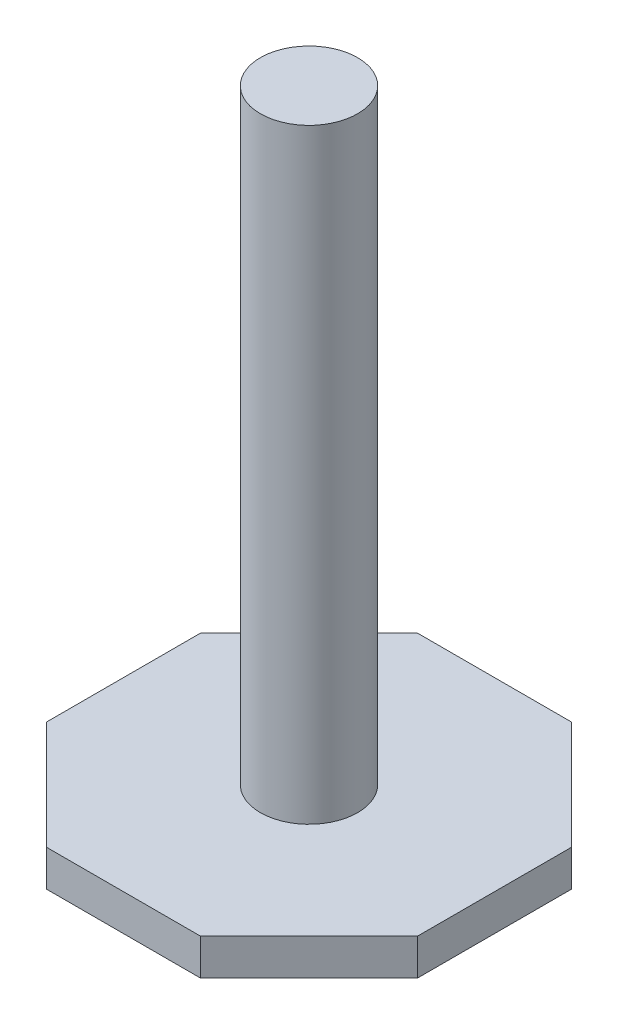
ISO-10303-21;
HEADER;
FILE_DESCRIPTION(('STEP AP214'),'2;1');
FILE_NAME('part.step','',(''),(''),'','','');
FILE_SCHEMA(('AUTOMOTIVE_DESIGN { 1 0 10303 214 1 1 1 1 }'));
ENDSEC;
DATA;
#1=APPLICATION_CONTEXT('core data for automotive mechanical design processes');
#2=APPLICATION_PROTOCOL_DEFINITION('international standard','automotive_design',2000,#1);
#3=PRODUCT_CONTEXT('',#1,'mechanical');
#4=PRODUCT('Part','Part','',(#3));
#5=PRODUCT_RELATED_PRODUCT_CATEGORY('part','',(#4));
#6=PRODUCT_DEFINITION_FORMATION('','',#4);
#7=PRODUCT_DEFINITION_CONTEXT('part definition',#1,'design');
#8=PRODUCT_DEFINITION('design','',#6,#7);
#9=PRODUCT_DEFINITION_SHAPE('','',#8);
#10=(LENGTH_UNIT() NAMED_UNIT(*) SI_UNIT(.MILLI.,.METRE.));
#11=(NAMED_UNIT(*) PLANE_ANGLE_UNIT() SI_UNIT($,.RADIAN.));
#12=(NAMED_UNIT(*) SI_UNIT($,.STERADIAN.) SOLID_ANGLE_UNIT());
#13=UNCERTAINTY_MEASURE_WITH_UNIT(LENGTH_MEASURE(1.E-05),#10,'distance_accuracy_value','');
#14=(GEOMETRIC_REPRESENTATION_CONTEXT(3) GLOBAL_UNCERTAINTY_ASSIGNED_CONTEXT((#13)) GLOBAL_UNIT_ASSIGNED_CONTEXT((#10,
#11,#12)) REPRESENTATION_CONTEXT('',''));
#15=CARTESIAN_POINT('',(0.,0.,0.));
#16=DIRECTION('',(0.,0.,1.));
#17=DIRECTION('',(1.,0.,0.));
#18=AXIS2_PLACEMENT_3D('',#15,#16,#17);
#19=CARTESIAN_POINT('',(0.,50.,0.));
#20=DIRECTION('',(0.,-1.,0.));
#21=DIRECTION('',(0.,0.,-1.));
#22=AXIS2_PLACEMENT_3D('',#19,#20,#21);
#23=CYLINDRICAL_SURFACE('',#22,4.015);
#24=CARTESIAN_POINT('',(0.,50.,0.));
#25=DIRECTION('',(0.,1.,0.));
#26=DIRECTION('',(0.,0.,1.));
#27=AXIS2_PLACEMENT_3D('',#24,#25,#26);
#28=CIRCLE('',#27,4.015);
#29=CARTESIAN_POINT('',(0.,50.,4.015));
#30=VERTEX_POINT('',#29);
#31=EDGE_CURVE('E11',#30,#30,#28,.T.);
#32=ORIENTED_EDGE('',*,*,#31,.F.);
#33=EDGE_LOOP('',(#32));
#34=FACE_BOUND('',#33,.T.);
#35=CARTESIAN_POINT('',(0.,0.,0.));
#36=DIRECTION('',(0.,1.,0.));
#37=DIRECTION('',(0.,0.,1.));
#38=AXIS2_PLACEMENT_3D('',#35,#36,#37);
#39=CIRCLE('',#38,4.015);
#40=CARTESIAN_POINT('',(0.,0.,4.015));
#41=VERTEX_POINT('',#40);
#42=EDGE_CURVE('E43',#41,#41,#39,.T.);
#43=ORIENTED_EDGE('',*,*,#42,.T.);
#44=EDGE_LOOP('',(#43));
#45=FACE_BOUND('',#44,.T.);
#46=ADVANCED_FACE('F40',(#34,#45),#23,.T.);
#47=CARTESIAN_POINT('',(0.,50.,0.));
#48=DIRECTION('',(0.,1.,0.));
#49=DIRECTION('',(0.,0.,1.));
#50=AXIS2_PLACEMENT_3D('',#47,#48,#49);
#51=PLANE('',#50);
#52=ORIENTED_EDGE('',*,*,#31,.T.);
#53=EDGE_LOOP('',(#52));
#54=FACE_BOUND('',#53,.T.);
#55=ADVANCED_FACE('F448',(#54),#51,.T.);
#56=CARTESIAN_POINT('',(15.3201327539249,-3.,6.34580676403199));
#57=DIRECTION('',(-0.707106781186547,0.,-0.707106781186548));
#58=DIRECTION('',(-0.707106781186548,0.,0.707106781186547));
#59=AXIS2_PLACEMENT_3D('',#56,#57,#58);
#60=PLANE('',#59);
#61=DIRECTION('',(-0.707106781186548,0.,0.707106781186547));
#62=VECTOR('',#61,1.);
#63=CARTESIAN_POINT('',(15.3201327539249,0.,6.34580676403199));
#64=LINE('',#63,#62);
#65=CARTESIAN_POINT('',(15.3201327539249,0.,6.34580676403199));
#66=VERTEX_POINT('',#65);
#67=CARTESIAN_POINT('',(6.34580676403198,0.,15.3201327539249));
#68=VERTEX_POINT('',#67);
#69=EDGE_CURVE('E303',#66,#68,#64,.T.);
#70=ORIENTED_EDGE('',*,*,#69,.T.);
#71=DIRECTION('',(0.,1.,0.));
#72=VECTOR('',#71,1.);
#73=CARTESIAN_POINT('',(6.34580676403198,-3.,15.3201327539249));
#74=LINE('',#73,#72);
#75=CARTESIAN_POINT('',(6.34580676403198,-3.,15.3201327539249));
#76=VERTEX_POINT('',#75);
#77=EDGE_CURVE('E385',#76,#68,#74,.T.);
#78=ORIENTED_EDGE('',*,*,#77,.F.);
#79=DIRECTION('',(-0.707106781186548,0.,0.707106781186547));
#80=VECTOR('',#79,1.);
#81=CARTESIAN_POINT('',(15.3201327539249,-3.,6.34580676403199));
#82=LINE('',#81,#80);
#83=CARTESIAN_POINT('',(15.3201327539249,-3.,6.34580676403199));
#84=VERTEX_POINT('',#83);
#85=EDGE_CURVE('E331',#84,#76,#82,.T.);
#86=ORIENTED_EDGE('',*,*,#85,.F.);
#87=DIRECTION('',(0.,1.,0.));
#88=VECTOR('',#87,1.);
#89=CARTESIAN_POINT('',(15.3201327539249,-3.,6.34580676403199));
#90=LINE('',#89,#88);
#91=EDGE_CURVE('E349',#84,#66,#90,.T.);
#92=ORIENTED_EDGE('',*,*,#91,.T.);
#93=EDGE_LOOP('',(#70,#78,#86,#92));
#94=FACE_BOUND('',#93,.T.);
#95=ADVANCED_FACE('F404',(#94),#60,.F.);
#96=CARTESIAN_POINT('',(6.34580676403198,-3.,15.3201327539249));
#97=DIRECTION('',(0.,0.,-1.));
#98=DIRECTION('',(-1.,0.,0.));
#99=AXIS2_PLACEMENT_3D('',#96,#97,#98);
#100=PLANE('',#99);
#101=DIRECTION('',(-1.,0.,0.));
#102=VECTOR('',#101,1.);
#103=CARTESIAN_POINT('',(6.34580676403198,0.,15.3201327539249));
#104=LINE('',#103,#102);
#105=CARTESIAN_POINT('',(-6.34580676403199,0.,15.3201327539249));
#106=VERTEX_POINT('',#105);
#107=EDGE_CURVE('E352',#68,#106,#104,.T.);
#108=ORIENTED_EDGE('',*,*,#107,.T.);
#109=DIRECTION('',(0.,1.,0.));
#110=VECTOR('',#109,1.);
#111=CARTESIAN_POINT('',(-6.34580676403199,-3.,15.3201327539249));
#112=LINE('',#111,#110);
#113=CARTESIAN_POINT('',(-6.34580676403199,-3.,15.3201327539249));
#114=VERTEX_POINT('',#113);
#115=EDGE_CURVE('E382',#114,#106,#112,.T.);
#116=ORIENTED_EDGE('',*,*,#115,.F.);
#117=DIRECTION('',(-1.,0.,0.));
#118=VECTOR('',#117,1.);
#119=CARTESIAN_POINT('',(6.34580676403198,-3.,15.3201327539249));
#120=LINE('',#119,#118);
#121=EDGE_CURVE('E334',#76,#114,#120,.T.);
#122=ORIENTED_EDGE('',*,*,#121,.F.);
#123=ORIENTED_EDGE('',*,*,#77,.T.);
#124=EDGE_LOOP('',(#108,#116,#122,#123));
#125=FACE_BOUND('',#124,.T.);
#126=ADVANCED_FACE('F434',(#125),#100,.F.);
#127=CARTESIAN_POINT('',(-6.34580676403199,-3.,15.3201327539249));
#128=DIRECTION('',(0.707106781186548,0.,-0.707106781186547));
#129=DIRECTION('',(-0.707106781186547,0.,-0.707106781186548));
#130=AXIS2_PLACEMENT_3D('',#127,#128,#129);
#131=PLANE('',#130);
#132=DIRECTION('',(-0.707106781186547,0.,-0.707106781186548));
#133=VECTOR('',#132,1.);
#134=CARTESIAN_POINT('',(-6.34580676403199,0.,15.3201327539249));
#135=LINE('',#134,#133);
#136=CARTESIAN_POINT('',(-15.3201327539249,0.,6.34580676403198));
#137=VERTEX_POINT('',#136);
#138=EDGE_CURVE('E354',#106,#137,#135,.T.);
#139=ORIENTED_EDGE('',*,*,#138,.T.);
#140=DIRECTION('',(0.,1.,0.));
#141=VECTOR('',#140,1.);
#142=CARTESIAN_POINT('',(-15.3201327539249,-3.,6.34580676403198));
#143=LINE('',#142,#141);
#144=CARTESIAN_POINT('',(-15.3201327539249,-3.,6.34580676403198));
#145=VERTEX_POINT('',#144);
#146=EDGE_CURVE('E379',#145,#137,#143,.T.);
#147=ORIENTED_EDGE('',*,*,#146,.F.);
#148=DIRECTION('',(-0.707106781186547,0.,-0.707106781186548));
#149=VECTOR('',#148,1.);
#150=CARTESIAN_POINT('',(-6.34580676403199,-3.,15.3201327539249));
#151=LINE('',#150,#149);
#152=EDGE_CURVE('E337',#114,#145,#151,.T.);
#153=ORIENTED_EDGE('',*,*,#152,.F.);
#154=ORIENTED_EDGE('',*,*,#115,.T.);
#155=EDGE_LOOP('',(#139,#147,#153,#154));
#156=FACE_BOUND('',#155,.T.);
#157=ADVANCED_FACE('F431',(#156),#131,.F.);
#158=CARTESIAN_POINT('',(-15.3201327539249,-3.,6.34580676403198));
#159=DIRECTION('',(1.,0.,0.));
#160=DIRECTION('',(0.,0.,-1.));
#161=AXIS2_PLACEMENT_3D('',#158,#159,#160);
#162=PLANE('',#161);
#163=DIRECTION('',(0.,0.,-1.));
#164=VECTOR('',#163,1.);
#165=CARTESIAN_POINT('',(-15.3201327539249,0.,6.34580676403198));
#166=LINE('',#165,#164);
#167=CARTESIAN_POINT('',(-15.3201327539249,0.,-6.34580676403198));
#168=VERTEX_POINT('',#167);
#169=EDGE_CURVE('E356',#137,#168,#166,.T.);
#170=ORIENTED_EDGE('',*,*,#169,.T.);
#171=DIRECTION('',(0.,1.,0.));
#172=VECTOR('',#171,1.);
#173=CARTESIAN_POINT('',(-15.3201327539249,-3.,-6.34580676403198));
#174=LINE('',#173,#172);
#175=CARTESIAN_POINT('',(-15.3201327539249,-3.,-6.34580676403198));
#176=VERTEX_POINT('',#175);
#177=EDGE_CURVE('E376',#176,#168,#174,.T.);
#178=ORIENTED_EDGE('',*,*,#177,.F.);
#179=DIRECTION('',(0.,0.,-1.));
#180=VECTOR('',#179,1.);
#181=CARTESIAN_POINT('',(-15.3201327539249,-3.,6.34580676403198));
#182=LINE('',#181,#180);
#183=EDGE_CURVE('E339',#145,#176,#182,.T.);
#184=ORIENTED_EDGE('',*,*,#183,.F.);
#185=ORIENTED_EDGE('',*,*,#146,.T.);
#186=EDGE_LOOP('',(#170,#178,#184,#185));
#187=FACE_BOUND('',#186,.T.);
#188=ADVANCED_FACE('F428',(#187),#162,.F.);
#189=CARTESIAN_POINT('',(-15.3201327539249,-3.,-6.34580676403198));
#190=DIRECTION('',(0.707106781186547,0.,0.707106781186548));
#191=DIRECTION('',(0.707106781186548,0.,-0.707106781186547));
#192=AXIS2_PLACEMENT_3D('',#189,#190,#191);
#193=PLANE('',#192);
#194=DIRECTION('',(0.707106781186548,0.,-0.707106781186547));
#195=VECTOR('',#194,1.);
#196=CARTESIAN_POINT('',(-15.3201327539249,0.,-6.34580676403198));
#197=LINE('',#196,#195);
#198=CARTESIAN_POINT('',(-6.34580676403198,0.,-15.3201327539249));
#199=VERTEX_POINT('',#198);
#200=EDGE_CURVE('E358',#168,#199,#197,.T.);
#201=ORIENTED_EDGE('',*,*,#200,.T.);
#202=DIRECTION('',(0.,1.,0.));
#203=VECTOR('',#202,1.);
#204=CARTESIAN_POINT('',(-6.34580676403198,-3.,-15.3201327539249));
#205=LINE('',#204,#203);
#206=CARTESIAN_POINT('',(-6.34580676403198,-3.,-15.3201327539249));
#207=VERTEX_POINT('',#206);
#208=EDGE_CURVE('E373',#207,#199,#205,.T.);
#209=ORIENTED_EDGE('',*,*,#208,.F.);
#210=DIRECTION('',(0.707106781186548,0.,-0.707106781186547));
#211=VECTOR('',#210,1.);
#212=CARTESIAN_POINT('',(-15.3201327539249,-3.,-6.34580676403198));
#213=LINE('',#212,#211);
#214=EDGE_CURVE('E341',#176,#207,#213,.T.);
#215=ORIENTED_EDGE('',*,*,#214,.F.);
#216=ORIENTED_EDGE('',*,*,#177,.T.);
#217=EDGE_LOOP('',(#201,#209,#215,#216));
#218=FACE_BOUND('',#217,.T.);
#219=ADVANCED_FACE('F424',(#218),#193,.F.);
#220=CARTESIAN_POINT('',(-6.34580676403198,-3.,-15.3201327539249));
#221=DIRECTION('',(0.,0.,1.));
#222=DIRECTION('',(1.,0.,0.));
#223=AXIS2_PLACEMENT_3D('',#220,#221,#222);
#224=PLANE('',#223);
#225=DIRECTION('',(1.,0.,0.));
#226=VECTOR('',#225,1.);
#227=CARTESIAN_POINT('',(-6.34580676403198,0.,-15.3201327539249));
#228=LINE('',#227,#226);
#229=CARTESIAN_POINT('',(6.34580676403199,0.,-15.3201327539249));
#230=VERTEX_POINT('',#229);
#231=EDGE_CURVE('E360',#199,#230,#228,.T.);
#232=ORIENTED_EDGE('',*,*,#231,.T.);
#233=DIRECTION('',(0.,1.,0.));
#234=VECTOR('',#233,1.);
#235=CARTESIAN_POINT('',(6.34580676403199,-3.,-15.3201327539249));
#236=LINE('',#235,#234);
#237=CARTESIAN_POINT('',(6.34580676403199,-3.,-15.3201327539249));
#238=VERTEX_POINT('',#237);
#239=EDGE_CURVE('E370',#238,#230,#236,.T.);
#240=ORIENTED_EDGE('',*,*,#239,.F.);
#241=DIRECTION('',(1.,0.,0.));
#242=VECTOR('',#241,1.);
#243=CARTESIAN_POINT('',(-6.34580676403198,-3.,-15.3201327539249));
#244=LINE('',#243,#242);
#245=EDGE_CURVE('E343',#207,#238,#244,.T.);
#246=ORIENTED_EDGE('',*,*,#245,.F.);
#247=ORIENTED_EDGE('',*,*,#208,.T.);
#248=EDGE_LOOP('',(#232,#240,#246,#247));
#249=FACE_BOUND('',#248,.T.);
#250=ADVANCED_FACE('F419',(#249),#224,.F.);
#251=CARTESIAN_POINT('',(6.34580676403199,-3.,-15.3201327539249));
#252=DIRECTION('',(-0.707106781186548,0.,0.707106781186547));
#253=DIRECTION('',(0.707106781186547,0.,0.707106781186548));
#254=AXIS2_PLACEMENT_3D('',#251,#252,#253);
#255=PLANE('',#254);
#256=DIRECTION('',(0.707106781186548,0.,0.707106781186548));
#257=VECTOR('',#256,1.);
#258=CARTESIAN_POINT('',(6.34580676403199,0.,-15.3201327539249));
#259=LINE('',#258,#257);
#260=CARTESIAN_POINT('',(15.3201327539249,0.,-6.34580676403198));
#261=VERTEX_POINT('',#260);
#262=EDGE_CURVE('E362',#230,#261,#259,.T.);
#263=ORIENTED_EDGE('',*,*,#262,.T.);
#264=DIRECTION('',(0.,1.,0.));
#265=VECTOR('',#264,1.);
#266=CARTESIAN_POINT('',(15.3201327539249,-3.,-6.34580676403198));
#267=LINE('',#266,#265);
#268=CARTESIAN_POINT('',(15.3201327539249,-3.,-6.34580676403198));
#269=VERTEX_POINT('',#268);
#270=EDGE_CURVE('E367',#269,#261,#267,.T.);
#271=ORIENTED_EDGE('',*,*,#270,.F.);
#272=DIRECTION('',(0.707106781186548,0.,0.707106781186548));
#273=VECTOR('',#272,1.);
#274=CARTESIAN_POINT('',(6.34580676403199,-3.,-15.3201327539249));
#275=LINE('',#274,#273);
#276=EDGE_CURVE('E345',#238,#269,#275,.T.);
#277=ORIENTED_EDGE('',*,*,#276,.F.);
#278=ORIENTED_EDGE('',*,*,#239,.T.);
#279=EDGE_LOOP('',(#263,#271,#277,#278));
#280=FACE_BOUND('',#279,.T.);
#281=ADVANCED_FACE('F413',(#280),#255,.F.);
#282=CARTESIAN_POINT('',(15.3201327539249,-3.,-6.34580676403198));
#283=DIRECTION('',(-1.,0.,0.));
#284=DIRECTION('',(0.,0.,1.));
#285=AXIS2_PLACEMENT_3D('',#282,#283,#284);
#286=PLANE('',#285);
#287=DIRECTION('',(0.,0.,1.));
#288=VECTOR('',#287,1.);
#289=CARTESIAN_POINT('',(15.3201327539249,0.,-6.34580676403198));
#290=LINE('',#289,#288);
#291=EDGE_CURVE('E335',#261,#66,#290,.T.);
#292=ORIENTED_EDGE('',*,*,#291,.T.);
#293=ORIENTED_EDGE('',*,*,#91,.F.);
#294=DIRECTION('',(0.,0.,1.));
#295=VECTOR('',#294,1.);
#296=CARTESIAN_POINT('',(15.3201327539249,-3.,-6.34580676403198));
#297=LINE('',#296,#295);
#298=EDGE_CURVE('E347',#269,#84,#297,.T.);
#299=ORIENTED_EDGE('',*,*,#298,.F.);
#300=ORIENTED_EDGE('',*,*,#270,.T.);
#301=EDGE_LOOP('',(#292,#293,#299,#300));
#302=FACE_BOUND('',#301,.T.);
#303=ADVANCED_FACE('F409',(#302),#286,.F.);
#304=CARTESIAN_POINT('',(0.,-3.,0.));
#305=DIRECTION('',(0.,-1.,0.));
#306=DIRECTION('',(0.,0.,-1.));
#307=AXIS2_PLACEMENT_3D('',#304,#305,#306);
#308=PLANE('',#307);
#309=DIRECTION('',(0.707106781186548,0.,-0.707106781186548));
#310=VECTOR('',#309,1.);
#311=CARTESIAN_POINT('',(-10.1258629777919,-3.,-10.1258629777919));
#312=LINE('',#311,#310);
#313=CARTESIAN_POINT('',(-14.3201327539249,-3.,-5.93159320165889));
#314=VERTEX_POINT('',#313);
#315=CARTESIAN_POINT('',(-5.93159320165889,-3.,-14.3201327539249));
#316=VERTEX_POINT('',#315);
#317=EDGE_CURVE('E62',#314,#316,#312,.T.);
#318=ORIENTED_EDGE('',*,*,#317,.F.);
#319=DIRECTION('',(0.,0.,-1.));
#320=VECTOR('',#319,1.);
#321=CARTESIAN_POINT('',(-14.3201327539249,-3.,0.));
#322=LINE('',#321,#320);
#323=CARTESIAN_POINT('',(-14.3201327539249,-3.,5.93159320165889));
#324=VERTEX_POINT('',#323);
#325=EDGE_CURVE('E223',#324,#314,#322,.T.);
#326=ORIENTED_EDGE('',*,*,#325,.F.);
#327=DIRECTION('',(-0.707106781186547,0.,-0.707106781186548));
#328=VECTOR('',#327,1.);
#329=CARTESIAN_POINT('',(-10.1258629777919,-3.,10.1258629777919));
#330=LINE('',#329,#328);
#331=CARTESIAN_POINT('',(-5.93159320165889,-3.,14.320132753925));
#332=VERTEX_POINT('',#331);
#333=EDGE_CURVE('E226',#332,#324,#330,.T.);
#334=ORIENTED_EDGE('',*,*,#333,.F.);
#335=DIRECTION('',(-1.,0.,0.));
#336=VECTOR('',#335,1.);
#337=CARTESIAN_POINT('',(0.,-3.,14.320132753925));
#338=LINE('',#337,#336);
#339=CARTESIAN_POINT('',(5.93159320165888,-3.,14.320132753925));
#340=VERTEX_POINT('',#339);
#341=EDGE_CURVE('E296',#340,#332,#338,.T.);
#342=ORIENTED_EDGE('',*,*,#341,.F.);
#343=DIRECTION('',(-0.707106781186548,0.,0.707106781186547));
#344=VECTOR('',#343,1.);
#345=CARTESIAN_POINT('',(10.1258629777919,-3.,10.1258629777919));
#346=LINE('',#345,#344);
#347=CARTESIAN_POINT('',(14.3201327539249,-3.,5.9315932016589));
#348=VERTEX_POINT('',#347);
#349=EDGE_CURVE('E293',#348,#340,#346,.T.);
#350=ORIENTED_EDGE('',*,*,#349,.F.);
#351=DIRECTION('',(0.,0.,1.));
#352=VECTOR('',#351,1.);
#353=CARTESIAN_POINT('',(14.3201327539249,-3.,0.));
#354=LINE('',#353,#352);
#355=CARTESIAN_POINT('',(14.3201327539249,-3.,-5.93159320165889));
#356=VERTEX_POINT('',#355);
#357=EDGE_CURVE('E290',#356,#348,#354,.T.);
#358=ORIENTED_EDGE('',*,*,#357,.F.);
#359=DIRECTION('',(0.707106781186547,0.,0.707106781186548));
#360=VECTOR('',#359,1.);
#361=CARTESIAN_POINT('',(10.1258629777919,-3.,-10.1258629777919));
#362=LINE('',#361,#360);
#363=CARTESIAN_POINT('',(5.9315932016589,-3.,-14.3201327539249));
#364=VERTEX_POINT('',#363);
#365=EDGE_CURVE('E287',#364,#356,#362,.T.);
#366=ORIENTED_EDGE('',*,*,#365,.F.);
#367=DIRECTION('',(1.,0.,0.));
#368=VECTOR('',#367,1.);
#369=CARTESIAN_POINT('',(0.,-3.,-14.3201327539249));
#370=LINE('',#369,#368);
#371=EDGE_CURVE('E284',#316,#364,#370,.T.);
#372=ORIENTED_EDGE('',*,*,#371,.F.);
#373=EDGE_LOOP('',(#318,#326,#334,#342,#350,#358,#366,#372));
#374=FACE_BOUND('',#373,.T.);
#375=ORIENTED_EDGE('',*,*,#85,.T.);
#376=ORIENTED_EDGE('',*,*,#121,.T.);
#377=ORIENTED_EDGE('',*,*,#152,.T.);
#378=ORIENTED_EDGE('',*,*,#183,.T.);
#379=ORIENTED_EDGE('',*,*,#214,.T.);
#380=ORIENTED_EDGE('',*,*,#245,.T.);
#381=ORIENTED_EDGE('',*,*,#276,.T.);
#382=ORIENTED_EDGE('',*,*,#298,.T.);
#383=EDGE_LOOP('',(#375,#376,#377,#378,#379,#380,#381,#382));
#384=FACE_BOUND('',#383,.T.);
#385=ADVANCED_FACE('F397',(#374,#384),#308,.T.);
#386=CARTESIAN_POINT('',(0.,0.,0.));
#387=DIRECTION('',(0.,-1.,0.));
#388=DIRECTION('',(0.,0.,-1.));
#389=AXIS2_PLACEMENT_3D('',#386,#387,#388);
#390=PLANE('',#389);
#391=ORIENTED_EDGE('',*,*,#42,.F.);
#392=EDGE_LOOP('',(#391));
#393=FACE_BOUND('',#392,.T.);
#394=ORIENTED_EDGE('',*,*,#69,.F.);
#395=ORIENTED_EDGE('',*,*,#291,.F.);
#396=ORIENTED_EDGE('',*,*,#262,.F.);
#397=ORIENTED_EDGE('',*,*,#231,.F.);
#398=ORIENTED_EDGE('',*,*,#200,.F.);
#399=ORIENTED_EDGE('',*,*,#169,.F.);
#400=ORIENTED_EDGE('',*,*,#138,.F.);
#401=ORIENTED_EDGE('',*,*,#107,.F.);
#402=EDGE_LOOP('',(#394,#395,#396,#397,#398,#399,#400,#401));
#403=FACE_BOUND('',#402,.T.);
#404=ADVANCED_FACE('F393',(#393,#403),#390,.F.);
#405=CARTESIAN_POINT('',(-10.1258629777919,-2.,-10.1258629777919));
#406=DIRECTION('',(-0.707106781186547,0.,-0.707106781186547));
#407=DIRECTION('',(-0.707106781186548,0.,0.707106781186548));
#408=AXIS2_PLACEMENT_3D('',#405,#406,#407);
#409=PLANE('',#408);
#410=ORIENTED_EDGE('',*,*,#317,.T.);
#411=DIRECTION('',(0.,-1.,0.));
#412=VECTOR('',#411,1.);
#413=CARTESIAN_POINT('',(-5.93159320165889,-2.,-14.3201327539249));
#414=LINE('',#413,#412);
#415=CARTESIAN_POINT('',(-5.93159320165889,-2.,-14.3201327539249));
#416=VERTEX_POINT('',#415);
#417=EDGE_CURVE('E316',#416,#316,#414,.T.);
#418=ORIENTED_EDGE('',*,*,#417,.F.);
#419=DIRECTION('',(0.707106781186548,0.,-0.707106781186548));
#420=VECTOR('',#419,1.);
#421=CARTESIAN_POINT('',(-10.1258629777919,-2.,-10.1258629777919));
#422=LINE('',#421,#420);
#423=CARTESIAN_POINT('',(-14.3201327539249,-2.,-5.93159320165889));
#424=VERTEX_POINT('',#423);
#425=EDGE_CURVE('E239',#424,#416,#422,.T.);
#426=ORIENTED_EDGE('',*,*,#425,.F.);
#427=DIRECTION('',(0.,-1.,0.));
#428=VECTOR('',#427,1.);
#429=CARTESIAN_POINT('',(-14.3201327539249,-2.,-5.93159320165889));
#430=LINE('',#429,#428);
#431=EDGE_CURVE('E301',#424,#314,#430,.T.);
#432=ORIENTED_EDGE('',*,*,#431,.T.);
#433=EDGE_LOOP('',(#410,#418,#426,#432));
#434=FACE_BOUND('',#433,.T.);
#435=ADVANCED_FACE('F396',(#434),#409,.F.);
#436=CARTESIAN_POINT('',(-14.3201327539249,-2.,0.));
#437=DIRECTION('',(-1.,0.,0.));
#438=DIRECTION('',(0.,0.,1.));
#439=AXIS2_PLACEMENT_3D('',#436,#437,#438);
#440=PLANE('',#439);
#441=ORIENTED_EDGE('',*,*,#325,.T.);
#442=ORIENTED_EDGE('',*,*,#431,.F.);
#443=DIRECTION('',(0.,0.,-1.));
#444=VECTOR('',#443,1.);
#445=CARTESIAN_POINT('',(-14.3201327539249,-2.,0.));
#446=LINE('',#445,#444);
#447=CARTESIAN_POINT('',(-14.3201327539249,-2.,5.93159320165889));
#448=VERTEX_POINT('',#447);
#449=EDGE_CURVE('E217',#448,#424,#446,.T.);
#450=ORIENTED_EDGE('',*,*,#449,.F.);
#451=DIRECTION('',(0.,-1.,0.));
#452=VECTOR('',#451,1.);
#453=CARTESIAN_POINT('',(-14.3201327539249,-2.,5.93159320165889));
#454=LINE('',#453,#452);
#455=EDGE_CURVE('E304',#448,#324,#454,.T.);
#456=ORIENTED_EDGE('',*,*,#455,.T.);
#457=EDGE_LOOP('',(#441,#442,#450,#456));
#458=FACE_BOUND('',#457,.T.);
#459=ADVANCED_FACE('F502',(#458),#440,.F.);
#460=CARTESIAN_POINT('',(-10.1258629777919,-2.,10.1258629777919));
#461=DIRECTION('',(-0.707106781186548,0.,0.707106781186547));
#462=DIRECTION('',(0.707106781186547,0.,0.707106781186548));
#463=AXIS2_PLACEMENT_3D('',#460,#461,#462);
#464=PLANE('',#463);
#465=ORIENTED_EDGE('',*,*,#333,.T.);
#466=ORIENTED_EDGE('',*,*,#455,.F.);
#467=DIRECTION('',(-0.707106781186547,0.,-0.707106781186548));
#468=VECTOR('',#467,1.);
#469=CARTESIAN_POINT('',(-10.1258629777919,-2.,10.1258629777919));
#470=LINE('',#469,#468);
#471=CARTESIAN_POINT('',(-5.93159320165889,-2.,14.320132753925));
#472=VERTEX_POINT('',#471);
#473=EDGE_CURVE('E257',#472,#448,#470,.T.);
#474=ORIENTED_EDGE('',*,*,#473,.F.);
#475=DIRECTION('',(0.,-1.,0.));
#476=VECTOR('',#475,1.);
#477=CARTESIAN_POINT('',(-5.93159320165889,-2.,14.320132753925));
#478=LINE('',#477,#476);
#479=EDGE_CURVE('E306',#472,#332,#478,.T.);
#480=ORIENTED_EDGE('',*,*,#479,.T.);
#481=EDGE_LOOP('',(#465,#466,#474,#480));
#482=FACE_BOUND('',#481,.T.);
#483=ADVANCED_FACE('F512',(#482),#464,.F.);
#484=CARTESIAN_POINT('',(0.,-2.,14.320132753925));
#485=DIRECTION('',(0.,0.,1.));
#486=DIRECTION('',(1.,0.,0.));
#487=AXIS2_PLACEMENT_3D('',#484,#485,#486);
#488=PLANE('',#487);
#489=ORIENTED_EDGE('',*,*,#341,.T.);
#490=ORIENTED_EDGE('',*,*,#479,.F.);
#491=DIRECTION('',(-1.,0.,0.));
#492=VECTOR('',#491,1.);
#493=CARTESIAN_POINT('',(0.,-2.,14.320132753925));
#494=LINE('',#493,#492);
#495=CARTESIAN_POINT('',(5.93159320165888,-2.,14.320132753925));
#496=VERTEX_POINT('',#495);
#497=EDGE_CURVE('E254',#496,#472,#494,.T.);
#498=ORIENTED_EDGE('',*,*,#497,.F.);
#499=DIRECTION('',(0.,-1.,0.));
#500=VECTOR('',#499,1.);
#501=CARTESIAN_POINT('',(5.93159320165888,-2.,14.320132753925));
#502=LINE('',#501,#500);
#503=EDGE_CURVE('E308',#496,#340,#502,.T.);
#504=ORIENTED_EDGE('',*,*,#503,.T.);
#505=EDGE_LOOP('',(#489,#490,#498,#504));
#506=FACE_BOUND('',#505,.T.);
#507=ADVANCED_FACE('F523',(#506),#488,.F.);
#508=CARTESIAN_POINT('',(10.1258629777919,-2.,10.1258629777919));
#509=DIRECTION('',(0.707106781186547,0.,0.707106781186548));
#510=DIRECTION('',(0.707106781186548,0.,-0.707106781186547));
#511=AXIS2_PLACEMENT_3D('',#508,#509,#510);
#512=PLANE('',#511);
#513=ORIENTED_EDGE('',*,*,#349,.T.);
#514=ORIENTED_EDGE('',*,*,#503,.F.);
#515=DIRECTION('',(-0.707106781186548,0.,0.707106781186547));
#516=VECTOR('',#515,1.);
#517=CARTESIAN_POINT('',(10.1258629777919,-2.,10.1258629777919));
#518=LINE('',#517,#516);
#519=CARTESIAN_POINT('',(14.3201327539249,-2.,5.9315932016589));
#520=VERTEX_POINT('',#519);
#521=EDGE_CURVE('E251',#520,#496,#518,.T.);
#522=ORIENTED_EDGE('',*,*,#521,.F.);
#523=DIRECTION('',(0.,-1.,0.));
#524=VECTOR('',#523,1.);
#525=CARTESIAN_POINT('',(14.3201327539249,-2.,5.9315932016589));
#526=LINE('',#525,#524);
#527=EDGE_CURVE('E310',#520,#348,#526,.T.);
#528=ORIENTED_EDGE('',*,*,#527,.T.);
#529=EDGE_LOOP('',(#513,#514,#522,#528));
#530=FACE_BOUND('',#529,.T.);
#531=ADVANCED_FACE('F534',(#530),#512,.F.);
#532=CARTESIAN_POINT('',(14.3201327539249,-2.,0.));
#533=DIRECTION('',(1.,0.,0.));
#534=DIRECTION('',(0.,0.,-1.));
#535=AXIS2_PLACEMENT_3D('',#532,#533,#534);
#536=PLANE('',#535);
#537=ORIENTED_EDGE('',*,*,#357,.T.);
#538=ORIENTED_EDGE('',*,*,#527,.F.);
#539=DIRECTION('',(0.,0.,1.));
#540=VECTOR('',#539,1.);
#541=CARTESIAN_POINT('',(14.3201327539249,-2.,0.));
#542=LINE('',#541,#540);
#543=CARTESIAN_POINT('',(14.3201327539249,-2.,-5.93159320165889));
#544=VERTEX_POINT('',#543);
#545=EDGE_CURVE('E248',#544,#520,#542,.T.);
#546=ORIENTED_EDGE('',*,*,#545,.F.);
#547=DIRECTION('',(0.,-1.,0.));
#548=VECTOR('',#547,1.);
#549=CARTESIAN_POINT('',(14.3201327539249,-2.,-5.93159320165889));
#550=LINE('',#549,#548);
#551=EDGE_CURVE('E312',#544,#356,#550,.T.);
#552=ORIENTED_EDGE('',*,*,#551,.T.);
#553=EDGE_LOOP('',(#537,#538,#546,#552));
#554=FACE_BOUND('',#553,.T.);
#555=ADVANCED_FACE('F545',(#554),#536,.F.);
#556=CARTESIAN_POINT('',(10.1258629777919,-2.,-10.1258629777919));
#557=DIRECTION('',(0.707106781186548,0.,-0.707106781186547));
#558=DIRECTION('',(-0.707106781186547,0.,-0.707106781186548));
#559=AXIS2_PLACEMENT_3D('',#556,#557,#558);
#560=PLANE('',#559);
#561=ORIENTED_EDGE('',*,*,#365,.T.);
#562=ORIENTED_EDGE('',*,*,#551,.F.);
#563=DIRECTION('',(0.707106781186547,0.,0.707106781186548));
#564=VECTOR('',#563,1.);
#565=CARTESIAN_POINT('',(10.1258629777919,-2.,-10.1258629777919));
#566=LINE('',#565,#564);
#567=CARTESIAN_POINT('',(5.9315932016589,-2.,-14.3201327539249));
#568=VERTEX_POINT('',#567);
#569=EDGE_CURVE('E245',#568,#544,#566,.T.);
#570=ORIENTED_EDGE('',*,*,#569,.F.);
#571=DIRECTION('',(0.,-1.,0.));
#572=VECTOR('',#571,1.);
#573=CARTESIAN_POINT('',(5.9315932016589,-2.,-14.3201327539249));
#574=LINE('',#573,#572);
#575=EDGE_CURVE('E314',#568,#364,#574,.T.);
#576=ORIENTED_EDGE('',*,*,#575,.T.);
#577=EDGE_LOOP('',(#561,#562,#570,#576));
#578=FACE_BOUND('',#577,.T.);
#579=ADVANCED_FACE('F556',(#578),#560,.F.);
#580=CARTESIAN_POINT('',(0.,-2.,-13.3201327539249));
#581=DIRECTION('',(0.,0.,-1.));
#582=DIRECTION('',(-1.,0.,0.));
#583=AXIS2_PLACEMENT_3D('',#580,#581,#582);
#584=PLANE('',#583);
#585=DIRECTION('',(1.,0.,0.));
#586=VECTOR('',#585,1.);
#587=CARTESIAN_POINT('',(0.,-3.,-13.3201327539249));
#588=LINE('',#587,#586);
#589=CARTESIAN_POINT('',(-5.5173796392858,-3.,-13.3201327539249));
#590=VERTEX_POINT('',#589);
#591=CARTESIAN_POINT('',(5.51737963928581,-3.,-13.3201327539249));
#592=VERTEX_POINT('',#591);
#593=EDGE_CURVE('E54',#590,#592,#588,.T.);
#594=ORIENTED_EDGE('',*,*,#593,.F.);
#595=DIRECTION('',(0.,-1.,0.));
#596=VECTOR('',#595,1.);
#597=CARTESIAN_POINT('',(-5.5173796392858,-2.,-13.3201327539249));
#598=LINE('',#597,#596);
#599=CARTESIAN_POINT('',(-5.5173796392858,-2.,-13.3201327539249));
#600=VERTEX_POINT('',#599);
#601=EDGE_CURVE('E205',#600,#590,#598,.T.);
#602=ORIENTED_EDGE('',*,*,#601,.F.);
#603=DIRECTION('',(1.,0.,0.));
#604=VECTOR('',#603,1.);
#605=CARTESIAN_POINT('',(0.,-2.,-13.3201327539249));
#606=LINE('',#605,#604);
#607=CARTESIAN_POINT('',(5.51737963928581,-2.,-13.3201327539249));
#608=VERTEX_POINT('',#607);
#609=EDGE_CURVE('E212',#600,#608,#606,.T.);
#610=ORIENTED_EDGE('',*,*,#609,.T.);
#611=DIRECTION('',(0.,-1.,0.));
#612=VECTOR('',#611,1.);
#613=CARTESIAN_POINT('',(5.51737963928581,-2.,-13.3201327539249));
#614=LINE('',#613,#612);
#615=EDGE_CURVE('E318',#608,#592,#614,.T.);
#616=ORIENTED_EDGE('',*,*,#615,.T.);
#617=EDGE_LOOP('',(#594,#602,#610,#616));
#618=FACE_BOUND('',#617,.T.);
#619=ADVANCED_FACE('F215',(#618),#584,.T.);
#620=CARTESIAN_POINT('',(9.41875619660538,-2.,-9.41875619660537));
#621=DIRECTION('',(0.707106781186548,0.,-0.707106781186547));
#622=DIRECTION('',(-0.707106781186547,0.,-0.707106781186548));
#623=AXIS2_PLACEMENT_3D('',#620,#621,#622);
#624=PLANE('',#623);
#625=DIRECTION('',(0.707106781186547,0.,0.707106781186548));
#626=VECTOR('',#625,1.);
#627=CARTESIAN_POINT('',(9.41875619660538,-3.,-9.41875619660537));
#628=LINE('',#627,#626);
#629=CARTESIAN_POINT('',(13.3201327539249,-3.,-5.5173796392858));
#630=VERTEX_POINT('',#629);
#631=EDGE_CURVE('E280',#592,#630,#628,.T.);
#632=ORIENTED_EDGE('',*,*,#631,.F.);
#633=ORIENTED_EDGE('',*,*,#615,.F.);
#634=DIRECTION('',(0.707106781186547,0.,0.707106781186548));
#635=VECTOR('',#634,1.);
#636=CARTESIAN_POINT('',(9.41875619660538,-2.,-9.41875619660537));
#637=LINE('',#636,#635);
#638=CARTESIAN_POINT('',(13.3201327539249,-2.,-5.5173796392858));
#639=VERTEX_POINT('',#638);
#640=EDGE_CURVE('E222',#608,#639,#637,.T.);
#641=ORIENTED_EDGE('',*,*,#640,.T.);
#642=DIRECTION('',(0.,-1.,0.));
#643=VECTOR('',#642,1.);
#644=CARTESIAN_POINT('',(13.3201327539249,-2.,-5.5173796392858));
#645=LINE('',#644,#643);
#646=EDGE_CURVE('E320',#639,#630,#645,.T.);
#647=ORIENTED_EDGE('',*,*,#646,.T.);
#648=EDGE_LOOP('',(#632,#633,#641,#647));
#649=FACE_BOUND('',#648,.T.);
#650=ADVANCED_FACE('F577',(#649),#624,.T.);
#651=CARTESIAN_POINT('',(13.3201327539249,-2.,0.));
#652=DIRECTION('',(1.,0.,0.));
#653=DIRECTION('',(0.,0.,-1.));
#654=AXIS2_PLACEMENT_3D('',#651,#652,#653);
#655=PLANE('',#654);
#656=DIRECTION('',(0.,0.,1.));
#657=VECTOR('',#656,1.);
#658=CARTESIAN_POINT('',(13.3201327539249,-3.,0.));
#659=LINE('',#658,#657);
#660=CARTESIAN_POINT('',(13.3201327539249,-3.,5.5173796392858));
#661=VERTEX_POINT('',#660);
#662=EDGE_CURVE('E277',#630,#661,#659,.T.);
#663=ORIENTED_EDGE('',*,*,#662,.F.);
#664=ORIENTED_EDGE('',*,*,#646,.F.);
#665=DIRECTION('',(0.,0.,1.));
#666=VECTOR('',#665,1.);
#667=CARTESIAN_POINT('',(13.3201327539249,-2.,0.));
#668=LINE('',#667,#666);
#669=CARTESIAN_POINT('',(13.3201327539249,-2.,5.5173796392858));
#670=VERTEX_POINT('',#669);
#671=EDGE_CURVE('E236',#639,#670,#668,.T.);
#672=ORIENTED_EDGE('',*,*,#671,.T.);
#673=DIRECTION('',(0.,-1.,0.));
#674=VECTOR('',#673,1.);
#675=CARTESIAN_POINT('',(13.3201327539249,-2.,5.5173796392858));
#676=LINE('',#675,#674);
#677=EDGE_CURVE('E322',#670,#661,#676,.T.);
#678=ORIENTED_EDGE('',*,*,#677,.T.);
#679=EDGE_LOOP('',(#663,#664,#672,#678));
#680=FACE_BOUND('',#679,.T.);
#681=ADVANCED_FACE('F586',(#680),#655,.T.);
#682=CARTESIAN_POINT('',(9.41875619660537,-2.,9.41875619660538));
#683=DIRECTION('',(0.707106781186547,0.,0.707106781186548));
#684=DIRECTION('',(0.707106781186548,0.,-0.707106781186547));
#685=AXIS2_PLACEMENT_3D('',#682,#683,#684);
#686=PLANE('',#685);
#687=DIRECTION('',(-0.707106781186548,0.,0.707106781186547));
#688=VECTOR('',#687,1.);
#689=CARTESIAN_POINT('',(9.41875619660537,-3.,9.41875619660538));
#690=LINE('',#689,#688);
#691=CARTESIAN_POINT('',(5.51737963928579,-3.,13.320132753925));
#692=VERTEX_POINT('',#691);
#693=EDGE_CURVE('E274',#661,#692,#690,.T.);
#694=ORIENTED_EDGE('',*,*,#693,.F.);
#695=ORIENTED_EDGE('',*,*,#677,.F.);
#696=DIRECTION('',(-0.707106781186548,0.,0.707106781186547));
#697=VECTOR('',#696,1.);
#698=CARTESIAN_POINT('',(9.41875619660537,-2.,9.41875619660538));
#699=LINE('',#698,#697);
#700=CARTESIAN_POINT('',(5.51737963928579,-2.,13.320132753925));
#701=VERTEX_POINT('',#700);
#702=EDGE_CURVE('E234',#670,#701,#699,.T.);
#703=ORIENTED_EDGE('',*,*,#702,.T.);
#704=DIRECTION('',(0.,-1.,0.));
#705=VECTOR('',#704,1.);
#706=CARTESIAN_POINT('',(5.51737963928579,-2.,13.320132753925));
#707=LINE('',#706,#705);
#708=EDGE_CURVE('E324',#701,#692,#707,.T.);
#709=ORIENTED_EDGE('',*,*,#708,.T.);
#710=EDGE_LOOP('',(#694,#695,#703,#709));
#711=FACE_BOUND('',#710,.T.);
#712=ADVANCED_FACE('F597',(#711),#686,.T.);
#713=CARTESIAN_POINT('',(0.,-2.,13.320132753925));
#714=DIRECTION('',(0.,0.,1.));
#715=DIRECTION('',(1.,0.,0.));
#716=AXIS2_PLACEMENT_3D('',#713,#714,#715);
#717=PLANE('',#716);
#718=DIRECTION('',(-1.,0.,0.));
#719=VECTOR('',#718,1.);
#720=CARTESIAN_POINT('',(0.,-3.,13.320132753925));
#721=LINE('',#720,#719);
#722=CARTESIAN_POINT('',(-5.5173796392858,-3.,13.3201327539249));
#723=VERTEX_POINT('',#722);
#724=EDGE_CURVE('E271',#692,#723,#721,.T.);
#725=ORIENTED_EDGE('',*,*,#724,.F.);
#726=ORIENTED_EDGE('',*,*,#708,.F.);
#727=DIRECTION('',(-1.,0.,0.));
#728=VECTOR('',#727,1.);
#729=CARTESIAN_POINT('',(0.,-2.,13.320132753925));
#730=LINE('',#729,#728);
#731=CARTESIAN_POINT('',(-5.5173796392858,-2.,13.3201327539249));
#732=VERTEX_POINT('',#731);
#733=EDGE_CURVE('E232',#701,#732,#730,.T.);
#734=ORIENTED_EDGE('',*,*,#733,.T.);
#735=DIRECTION('',(0.,-1.,0.));
#736=VECTOR('',#735,1.);
#737=CARTESIAN_POINT('',(-5.5173796392858,-2.,13.3201327539249));
#738=LINE('',#737,#736);
#739=EDGE_CURVE('E326',#732,#723,#738,.T.);
#740=ORIENTED_EDGE('',*,*,#739,.T.);
#741=EDGE_LOOP('',(#725,#726,#734,#740));
#742=FACE_BOUND('',#741,.T.);
#743=ADVANCED_FACE('F608',(#742),#717,.T.);
#744=CARTESIAN_POINT('',(-9.41875619660538,-2.,9.41875619660537));
#745=DIRECTION('',(-0.707106781186548,0.,0.707106781186547));
#746=DIRECTION('',(0.707106781186547,0.,0.707106781186548));
#747=AXIS2_PLACEMENT_3D('',#744,#745,#746);
#748=PLANE('',#747);
#749=DIRECTION('',(-0.707106781186547,0.,-0.707106781186548));
#750=VECTOR('',#749,1.);
#751=CARTESIAN_POINT('',(-9.41875619660538,-3.,9.41875619660537));
#752=LINE('',#751,#750);
#753=CARTESIAN_POINT('',(-13.3201327539249,-3.,5.5173796392858));
#754=VERTEX_POINT('',#753);
#755=EDGE_CURVE('E268',#723,#754,#752,.T.);
#756=ORIENTED_EDGE('',*,*,#755,.F.);
#757=ORIENTED_EDGE('',*,*,#739,.F.);
#758=DIRECTION('',(-0.707106781186547,0.,-0.707106781186548));
#759=VECTOR('',#758,1.);
#760=CARTESIAN_POINT('',(-9.41875619660538,-2.,9.41875619660537));
#761=LINE('',#760,#759);
#762=CARTESIAN_POINT('',(-13.3201327539249,-2.,5.5173796392858));
#763=VERTEX_POINT('',#762);
#764=EDGE_CURVE('E230',#732,#763,#761,.T.);
#765=ORIENTED_EDGE('',*,*,#764,.T.);
#766=DIRECTION('',(0.,-1.,0.));
#767=VECTOR('',#766,1.);
#768=CARTESIAN_POINT('',(-13.3201327539249,-2.,5.5173796392858));
#769=LINE('',#768,#767);
#770=EDGE_CURVE('E328',#763,#754,#769,.T.);
#771=ORIENTED_EDGE('',*,*,#770,.T.);
#772=EDGE_LOOP('',(#756,#757,#765,#771));
#773=FACE_BOUND('',#772,.T.);
#774=ADVANCED_FACE('F619',(#773),#748,.T.);
#775=CARTESIAN_POINT('',(-13.3201327539249,-2.,0.));
#776=DIRECTION('',(-1.,0.,0.));
#777=DIRECTION('',(0.,0.,1.));
#778=AXIS2_PLACEMENT_3D('',#775,#776,#777);
#779=PLANE('',#778);
#780=DIRECTION('',(0.,0.,-1.));
#781=VECTOR('',#780,1.);
#782=CARTESIAN_POINT('',(-13.3201327539249,-3.,0.));
#783=LINE('',#782,#781);
#784=CARTESIAN_POINT('',(-13.3201327539249,-3.,-5.5173796392858));
#785=VERTEX_POINT('',#784);
#786=EDGE_CURVE('E265',#754,#785,#783,.T.);
#787=ORIENTED_EDGE('',*,*,#786,.F.);
#788=ORIENTED_EDGE('',*,*,#770,.F.);
#789=DIRECTION('',(0.,0.,-1.));
#790=VECTOR('',#789,1.);
#791=CARTESIAN_POINT('',(-13.3201327539249,-2.,0.));
#792=LINE('',#791,#790);
#793=CARTESIAN_POINT('',(-13.3201327539249,-2.,-5.5173796392858));
#794=VERTEX_POINT('',#793);
#795=EDGE_CURVE('E211',#763,#794,#792,.T.);
#796=ORIENTED_EDGE('',*,*,#795,.T.);
#797=DIRECTION('',(0.,-1.,0.));
#798=VECTOR('',#797,1.);
#799=CARTESIAN_POINT('',(-13.3201327539249,-2.,-5.5173796392858));
#800=LINE('',#799,#798);
#801=EDGE_CURVE('E207',#794,#785,#800,.T.);
#802=ORIENTED_EDGE('',*,*,#801,.T.);
#803=EDGE_LOOP('',(#787,#788,#796,#802));
#804=FACE_BOUND('',#803,.T.);
#805=ADVANCED_FACE('F630',(#804),#779,.T.);
#806=CARTESIAN_POINT('',(-9.41875619660537,-2.,-9.41875619660537));
#807=DIRECTION('',(-0.707106781186547,0.,-0.707106781186547));
#808=DIRECTION('',(-0.707106781186548,0.,0.707106781186548));
#809=AXIS2_PLACEMENT_3D('',#806,#807,#808);
#810=PLANE('',#809);
#811=DIRECTION('',(0.707106781186548,0.,-0.707106781186548));
#812=VECTOR('',#811,1.);
#813=CARTESIAN_POINT('',(-9.41875619660537,-3.,-9.41875619660537));
#814=LINE('',#813,#812);
#815=EDGE_CURVE('E263',#785,#590,#814,.T.);
#816=ORIENTED_EDGE('',*,*,#815,.F.);
#817=ORIENTED_EDGE('',*,*,#801,.F.);
#818=DIRECTION('',(0.707106781186548,0.,-0.707106781186548));
#819=VECTOR('',#818,1.);
#820=CARTESIAN_POINT('',(-9.41875619660537,-2.,-9.41875619660537));
#821=LINE('',#820,#819);
#822=EDGE_CURVE('E202',#794,#600,#821,.T.);
#823=ORIENTED_EDGE('',*,*,#822,.T.);
#824=ORIENTED_EDGE('',*,*,#601,.T.);
#825=EDGE_LOOP('',(#816,#817,#823,#824));
#826=FACE_BOUND('',#825,.T.);
#827=ADVANCED_FACE('F204',(#826),#810,.T.);
#828=CARTESIAN_POINT('',(0.,-2.,-14.3201327539249));
#829=DIRECTION('',(0.,0.,-1.));
#830=DIRECTION('',(-1.,0.,0.));
#831=AXIS2_PLACEMENT_3D('',#828,#829,#830);
#832=PLANE('',#831);
#833=ORIENTED_EDGE('',*,*,#371,.T.);
#834=ORIENTED_EDGE('',*,*,#575,.F.);
#835=DIRECTION('',(1.,0.,0.));
#836=VECTOR('',#835,1.);
#837=CARTESIAN_POINT('',(0.,-2.,-14.3201327539249));
#838=LINE('',#837,#836);
#839=EDGE_CURVE('E242',#416,#568,#838,.T.);
#840=ORIENTED_EDGE('',*,*,#839,.F.);
#841=ORIENTED_EDGE('',*,*,#417,.T.);
#842=EDGE_LOOP('',(#833,#834,#840,#841));
#843=FACE_BOUND('',#842,.T.);
#844=ADVANCED_FACE('F651',(#843),#832,.F.);
#845=CARTESIAN_POINT('',(0.,-2.,0.));
#846=DIRECTION('',(0.,-1.,0.));
#847=DIRECTION('',(0.,0.,-1.));
#848=AXIS2_PLACEMENT_3D('',#845,#846,#847);
#849=PLANE('',#848);
#850=ORIENTED_EDGE('',*,*,#609,.F.);
#851=ORIENTED_EDGE('',*,*,#822,.F.);
#852=ORIENTED_EDGE('',*,*,#795,.F.);
#853=ORIENTED_EDGE('',*,*,#764,.F.);
#854=ORIENTED_EDGE('',*,*,#733,.F.);
#855=ORIENTED_EDGE('',*,*,#702,.F.);
#856=ORIENTED_EDGE('',*,*,#671,.F.);
#857=ORIENTED_EDGE('',*,*,#640,.F.);
#858=EDGE_LOOP('',(#850,#851,#852,#853,#854,#855,#856,#857));
#859=FACE_BOUND('',#858,.T.);
#860=ORIENTED_EDGE('',*,*,#425,.T.);
#861=ORIENTED_EDGE('',*,*,#839,.T.);
#862=ORIENTED_EDGE('',*,*,#569,.T.);
#863=ORIENTED_EDGE('',*,*,#545,.T.);
#864=ORIENTED_EDGE('',*,*,#521,.T.);
#865=ORIENTED_EDGE('',*,*,#497,.T.);
#866=ORIENTED_EDGE('',*,*,#473,.T.);
#867=ORIENTED_EDGE('',*,*,#449,.T.);
#868=EDGE_LOOP('',(#860,#861,#862,#863,#864,#865,#866,#867));
#869=FACE_BOUND('',#868,.T.);
#870=ADVANCED_FACE('F219',(#859,#869),#849,.T.);
#871=ORIENTED_EDGE('',*,*,#815,.T.);
#872=ORIENTED_EDGE('',*,*,#593,.T.);
#873=ORIENTED_EDGE('',*,*,#631,.T.);
#874=ORIENTED_EDGE('',*,*,#662,.T.);
#875=ORIENTED_EDGE('',*,*,#693,.T.);
#876=ORIENTED_EDGE('',*,*,#724,.T.);
#877=ORIENTED_EDGE('',*,*,#755,.T.);
#878=ORIENTED_EDGE('',*,*,#786,.T.);
#879=EDGE_LOOP('',(#871,#872,#873,#874,#875,#876,#877,#878));
#880=FACE_BOUND('',#879,.T.);
#881=ADVANCED_FACE('F439',(#880),#308,.T.);
#882=CLOSED_SHELL('',(#46,#55,#95,#126,#157,#188,#219,#250,#281,#303,#385,#404,#435,#459,#483,
#507,#531,#555,#579,#619,#650,#681,#712,#743,#774,#805,#827,#844,#870,#881));
#883=MANIFOLD_SOLID_BREP('B2',#882);
#884=ADVANCED_BREP_SHAPE_REPRESENTATION('',(#18,#883),#14);
#885=SHAPE_DEFINITION_REPRESENTATION(#9,#884);
ENDSEC;
END-ISO-10303-21;
